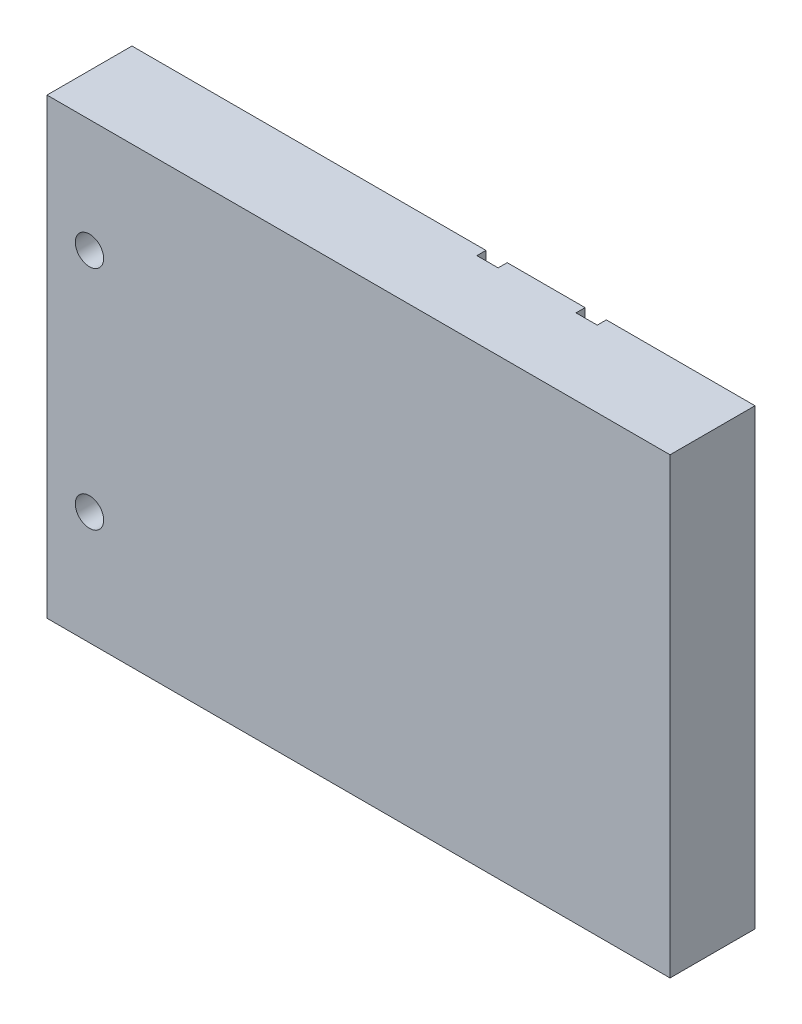
ISO-10303-21;
HEADER;
FILE_DESCRIPTION(('STEP AP214'),'2;1');
FILE_NAME('part.step','',(''),(''),'','','');
FILE_SCHEMA(('AUTOMOTIVE_DESIGN { 1 0 10303 214 1 1 1 1 }'));
ENDSEC;
DATA;
#1=APPLICATION_CONTEXT('core data for automotive mechanical design processes');
#2=APPLICATION_PROTOCOL_DEFINITION('international standard','automotive_design',2000,#1);
#3=PRODUCT_CONTEXT('',#1,'mechanical');
#4=PRODUCT('Part','Part','',(#3));
#5=PRODUCT_RELATED_PRODUCT_CATEGORY('part','',(#4));
#6=PRODUCT_DEFINITION_FORMATION('','',#4);
#7=PRODUCT_DEFINITION_CONTEXT('part definition',#1,'design');
#8=PRODUCT_DEFINITION('design','',#6,#7);
#9=PRODUCT_DEFINITION_SHAPE('','',#8);
#10=(LENGTH_UNIT() NAMED_UNIT(*) SI_UNIT(.MILLI.,.METRE.));
#11=(NAMED_UNIT(*) PLANE_ANGLE_UNIT() SI_UNIT($,.RADIAN.));
#12=(NAMED_UNIT(*) SI_UNIT($,.STERADIAN.) SOLID_ANGLE_UNIT());
#13=UNCERTAINTY_MEASURE_WITH_UNIT(LENGTH_MEASURE(1.E-05),#10,'distance_accuracy_value','');
#14=(GEOMETRIC_REPRESENTATION_CONTEXT(3) GLOBAL_UNCERTAINTY_ASSIGNED_CONTEXT((#13)) GLOBAL_UNIT_ASSIGNED_CONTEXT((#10,
#11,#12)) REPRESENTATION_CONTEXT('',''));
#15=CARTESIAN_POINT('',(0.,0.,0.));
#16=DIRECTION('',(0.,0.,1.));
#17=DIRECTION('',(1.,0.,0.));
#18=AXIS2_PLACEMENT_3D('',#15,#16,#17);
#19=CARTESIAN_POINT('',(-113.980579252451,50.8000000000002,0.));
#20=DIRECTION('',(0.,1.,0.));
#21=DIRECTION('',(0.,0.,1.));
#22=AXIS2_PLACEMENT_3D('',#19,#20,#21);
#23=PLANE('',#22);
#24=DIRECTION('',(0.,0.,1.));
#25=VECTOR('',#24,1.);
#26=CARTESIAN_POINT('',(-69.85,50.8,-9.525));
#27=LINE('',#26,#25);
#28=CARTESIAN_POINT('',(-69.85,50.8,-9.525));
#29=VERTEX_POINT('',#28);
#30=CARTESIAN_POINT('',(-69.85,50.8,9.525));
#31=VERTEX_POINT('',#30);
#32=EDGE_CURVE('E63',#29,#31,#27,.T.);
#33=ORIENTED_EDGE('',*,*,#32,.T.);
#34=DIRECTION('',(1.,0.,0.));
#35=VECTOR('',#34,1.);
#36=CARTESIAN_POINT('',(-69.85,50.8,9.52500000000001));
#37=LINE('',#36,#35);
#38=CARTESIAN_POINT('',(69.85,50.8,9.525));
#39=VERTEX_POINT('',#38);
#40=EDGE_CURVE('E42',#31,#39,#37,.T.);
#41=ORIENTED_EDGE('',*,*,#40,.T.);
#42=DIRECTION('',(0.,0.,-1.));
#43=VECTOR('',#42,1.);
#44=CARTESIAN_POINT('',(69.85,50.8,-9.525));
#45=LINE('',#44,#43);
#46=CARTESIAN_POINT('',(69.85,50.8,-9.525));
#47=VERTEX_POINT('',#46);
#48=EDGE_CURVE('E150',#39,#47,#45,.T.);
#49=ORIENTED_EDGE('',*,*,#48,.T.);
#50=DIRECTION('',(-1.,0.,0.));
#51=VECTOR('',#50,1.);
#52=CARTESIAN_POINT('',(69.85,50.8,-9.525));
#53=LINE('',#52,#51);
#54=CARTESIAN_POINT('',(36.5125,50.8,-9.525));
#55=VERTEX_POINT('',#54);
#56=EDGE_CURVE('E187',#47,#55,#53,.T.);
#57=ORIENTED_EDGE('',*,*,#56,.T.);
#58=DIRECTION('',(0.,0.,1.));
#59=VECTOR('',#58,1.);
#60=CARTESIAN_POINT('',(36.5125,50.8,-9.525));
#61=LINE('',#60,#59);
#62=CARTESIAN_POINT('',(36.5125,50.8,-7.49299999999999));
#63=VERTEX_POINT('',#62);
#64=EDGE_CURVE('E200',#55,#63,#61,.T.);
#65=ORIENTED_EDGE('',*,*,#64,.T.);
#66=DIRECTION('',(-1.,0.,0.));
#67=VECTOR('',#66,1.);
#68=CARTESIAN_POINT('',(36.5125,50.8,-7.49299999999999));
#69=LINE('',#68,#67);
#70=CARTESIAN_POINT('',(31.75,50.8,-7.49299999999999));
#71=VERTEX_POINT('',#70);
#72=EDGE_CURVE('E214',#63,#71,#69,.T.);
#73=ORIENTED_EDGE('',*,*,#72,.T.);
#74=DIRECTION('',(0.,0.,-1.));
#75=VECTOR('',#74,1.);
#76=CARTESIAN_POINT('',(31.75,50.8,-9.525));
#77=LINE('',#76,#75);
#78=CARTESIAN_POINT('',(31.75,50.8,-9.525));
#79=VERTEX_POINT('',#78);
#80=EDGE_CURVE('E228',#71,#79,#77,.T.);
#81=ORIENTED_EDGE('',*,*,#80,.T.);
#82=DIRECTION('',(-1.,0.,0.));
#83=VECTOR('',#82,1.);
#84=CARTESIAN_POINT('',(31.75,50.8,-9.525));
#85=LINE('',#84,#83);
#86=CARTESIAN_POINT('',(14.2875,50.8,-9.525));
#87=VERTEX_POINT('',#86);
#88=EDGE_CURVE('E242',#79,#87,#85,.T.);
#89=ORIENTED_EDGE('',*,*,#88,.T.);
#90=DIRECTION('',(0.,0.,1.));
#91=VECTOR('',#90,1.);
#92=CARTESIAN_POINT('',(14.2875,50.8,-9.525));
#93=LINE('',#92,#91);
#94=CARTESIAN_POINT('',(14.2875,50.8,-7.49299999999999));
#95=VERTEX_POINT('',#94);
#96=EDGE_CURVE('E256',#87,#95,#93,.T.);
#97=ORIENTED_EDGE('',*,*,#96,.T.);
#98=DIRECTION('',(-1.,0.,0.));
#99=VECTOR('',#98,1.);
#100=CARTESIAN_POINT('',(9.525,50.8,-7.49299999999999));
#101=LINE('',#100,#99);
#102=CARTESIAN_POINT('',(9.525,50.8,-7.49299999999999));
#103=VERTEX_POINT('',#102);
#104=EDGE_CURVE('E81',#95,#103,#101,.T.);
#105=ORIENTED_EDGE('',*,*,#104,.T.);
#106=DIRECTION('',(0.,0.,-1.));
#107=VECTOR('',#106,1.);
#108=CARTESIAN_POINT('',(9.525,50.8,-9.525));
#109=LINE('',#108,#107);
#110=CARTESIAN_POINT('',(9.525,50.8,-9.525));
#111=VERTEX_POINT('',#110);
#112=EDGE_CURVE('E75',#103,#111,#109,.T.);
#113=ORIENTED_EDGE('',*,*,#112,.T.);
#114=DIRECTION('',(-1.,0.,0.));
#115=VECTOR('',#114,1.);
#116=CARTESIAN_POINT('',(9.525,50.8,-9.525));
#117=LINE('',#116,#115);
#118=EDGE_CURVE('E70',#111,#29,#117,.T.);
#119=ORIENTED_EDGE('',*,*,#118,.T.);
#120=EDGE_LOOP('',(#33,#41,#49,#57,#65,#73,#81,#89,#97,#105,#113,#119));
#121=FACE_BOUND('',#120,.T.);
#122=ADVANCED_FACE('F33',(#121),#23,.T.);
#123=CARTESIAN_POINT('',(-113.980579252451,-50.7999999999998,0.));
#124=DIRECTION('',(0.,1.,0.));
#125=DIRECTION('',(0.,0.,1.));
#126=AXIS2_PLACEMENT_3D('',#123,#124,#125);
#127=PLANE('',#126);
#128=DIRECTION('',(0.,0.,1.));
#129=VECTOR('',#128,1.);
#130=CARTESIAN_POINT('',(-69.85,-50.8,-9.525));
#131=LINE('',#130,#129);
#132=CARTESIAN_POINT('',(-69.85,-50.8,-9.525));
#133=VERTEX_POINT('',#132);
#134=CARTESIAN_POINT('',(-69.85,-50.8,9.525));
#135=VERTEX_POINT('',#134);
#136=EDGE_CURVE('E158',#133,#135,#131,.T.);
#137=ORIENTED_EDGE('',*,*,#136,.F.);
#138=DIRECTION('',(-1.,0.,0.));
#139=VECTOR('',#138,1.);
#140=CARTESIAN_POINT('',(9.525,-50.8,-9.525));
#141=LINE('',#140,#139);
#142=CARTESIAN_POINT('',(9.525,-50.8,-9.525));
#143=VERTEX_POINT('',#142);
#144=EDGE_CURVE('E90',#143,#133,#141,.T.);
#145=ORIENTED_EDGE('',*,*,#144,.F.);
#146=DIRECTION('',(0.,0.,-1.));
#147=VECTOR('',#146,1.);
#148=CARTESIAN_POINT('',(9.525,-50.8,-9.525));
#149=LINE('',#148,#147);
#150=CARTESIAN_POINT('',(9.525,-50.8,-7.49299999999999));
#151=VERTEX_POINT('',#150);
#152=EDGE_CURVE('E95',#151,#143,#149,.T.);
#153=ORIENTED_EDGE('',*,*,#152,.F.);
#154=DIRECTION('',(-1.,0.,0.));
#155=VECTOR('',#154,1.);
#156=CARTESIAN_POINT('',(9.525,-50.8,-7.49299999999999));
#157=LINE('',#156,#155);
#158=CARTESIAN_POINT('',(14.2875,-50.8,-7.49299999999999));
#159=VERTEX_POINT('',#158);
#160=EDGE_CURVE('E101',#159,#151,#157,.T.);
#161=ORIENTED_EDGE('',*,*,#160,.F.);
#162=DIRECTION('',(0.,0.,1.));
#163=VECTOR('',#162,1.);
#164=CARTESIAN_POINT('',(14.2875,-50.8,-9.525));
#165=LINE('',#164,#163);
#166=CARTESIAN_POINT('',(14.2875,-50.8,-9.525));
#167=VERTEX_POINT('',#166);
#168=EDGE_CURVE('E250',#167,#159,#165,.T.);
#169=ORIENTED_EDGE('',*,*,#168,.F.);
#170=DIRECTION('',(-1.,0.,0.));
#171=VECTOR('',#170,1.);
#172=CARTESIAN_POINT('',(31.75,-50.8,-9.525));
#173=LINE('',#172,#171);
#174=CARTESIAN_POINT('',(31.75,-50.8,-9.525));
#175=VERTEX_POINT('',#174);
#176=EDGE_CURVE('E236',#175,#167,#173,.T.);
#177=ORIENTED_EDGE('',*,*,#176,.F.);
#178=DIRECTION('',(0.,0.,-1.));
#179=VECTOR('',#178,1.);
#180=CARTESIAN_POINT('',(31.75,-50.8,-9.525));
#181=LINE('',#180,#179);
#182=CARTESIAN_POINT('',(31.75,-50.8,-7.49299999999999));
#183=VERTEX_POINT('',#182);
#184=EDGE_CURVE('E222',#183,#175,#181,.T.);
#185=ORIENTED_EDGE('',*,*,#184,.F.);
#186=DIRECTION('',(-1.,0.,0.));
#187=VECTOR('',#186,1.);
#188=CARTESIAN_POINT('',(36.5125,-50.8,-7.49299999999999));
#189=LINE('',#188,#187);
#190=CARTESIAN_POINT('',(36.5125,-50.8,-7.49299999999999));
#191=VERTEX_POINT('',#190);
#192=EDGE_CURVE('E208',#191,#183,#189,.T.);
#193=ORIENTED_EDGE('',*,*,#192,.F.);
#194=DIRECTION('',(0.,0.,1.));
#195=VECTOR('',#194,1.);
#196=CARTESIAN_POINT('',(36.5125,-50.8,-9.525));
#197=LINE('',#196,#195);
#198=CARTESIAN_POINT('',(36.5125,-50.8,-9.525));
#199=VERTEX_POINT('',#198);
#200=EDGE_CURVE('E194',#199,#191,#197,.T.);
#201=ORIENTED_EDGE('',*,*,#200,.F.);
#202=DIRECTION('',(-1.,0.,0.));
#203=VECTOR('',#202,1.);
#204=CARTESIAN_POINT('',(69.85,-50.8,-9.525));
#205=LINE('',#204,#203);
#206=CARTESIAN_POINT('',(69.85,-50.8,-9.525));
#207=VERTEX_POINT('',#206);
#208=EDGE_CURVE('E141',#207,#199,#205,.T.);
#209=ORIENTED_EDGE('',*,*,#208,.F.);
#210=DIRECTION('',(0.,0.,-1.));
#211=VECTOR('',#210,1.);
#212=CARTESIAN_POINT('',(69.85,-50.8,-9.525));
#213=LINE('',#212,#211);
#214=CARTESIAN_POINT('',(69.85,-50.8,9.525));
#215=VERTEX_POINT('',#214);
#216=EDGE_CURVE('E137',#215,#207,#213,.T.);
#217=ORIENTED_EDGE('',*,*,#216,.F.);
#218=DIRECTION('',(1.,0.,0.));
#219=VECTOR('',#218,1.);
#220=CARTESIAN_POINT('',(-69.85,-50.8,9.52500000000001));
#221=LINE('',#220,#219);
#222=EDGE_CURVE('E12',#135,#215,#221,.T.);
#223=ORIENTED_EDGE('',*,*,#222,.F.);
#224=EDGE_LOOP('',(#137,#145,#153,#161,#169,#177,#185,#193,#201,#209,#217,#223));
#225=FACE_BOUND('',#224,.T.);
#226=ADVANCED_FACE('F139',(#225),#127,.F.);
#227=CARTESIAN_POINT('',(-69.85,-50.8,-9.525));
#228=DIRECTION('',(-1.,0.,0.));
#229=DIRECTION('',(0.,0.,1.));
#230=AXIS2_PLACEMENT_3D('',#227,#228,#229);
#231=PLANE('',#230);
#232=ORIENTED_EDGE('',*,*,#32,.F.);
#233=DIRECTION('',(0.,1.,0.));
#234=VECTOR('',#233,1.);
#235=CARTESIAN_POINT('',(-69.85,-50.8,-9.525));
#236=LINE('',#235,#234);
#237=EDGE_CURVE('E162',#133,#29,#236,.T.);
#238=ORIENTED_EDGE('',*,*,#237,.F.);
#239=ORIENTED_EDGE('',*,*,#136,.T.);
#240=DIRECTION('',(0.,1.,0.));
#241=VECTOR('',#240,1.);
#242=CARTESIAN_POINT('',(-69.85,-50.8,9.52500000000001));
#243=LINE('',#242,#241);
#244=EDGE_CURVE('E155',#135,#31,#243,.T.);
#245=ORIENTED_EDGE('',*,*,#244,.T.);
#246=EDGE_LOOP('',(#232,#238,#239,#245));
#247=FACE_BOUND('',#246,.T.);
#248=ADVANCED_FACE('F161',(#247),#231,.T.);
#249=CARTESIAN_POINT('',(9.525,-50.8,-9.525));
#250=DIRECTION('',(0.,0.,-1.));
#251=DIRECTION('',(-1.,0.,0.));
#252=AXIS2_PLACEMENT_3D('',#249,#250,#251);
#253=PLANE('',#252);
#254=CARTESIAN_POINT('',(-60.325,-25.4,-9.525));
#255=DIRECTION('',(0.,0.,-1.));
#256=DIRECTION('',(-1.,0.,0.));
#257=AXIS2_PLACEMENT_3D('',#254,#255,#256);
#258=CIRCLE('',#257,3.17499999999999);
#259=CARTESIAN_POINT('',(-63.5,-25.4,-9.525));
#260=VERTEX_POINT('',#259);
#261=EDGE_CURVE('E372',#260,#260,#258,.T.);
#262=ORIENTED_EDGE('',*,*,#261,.F.);
#263=EDGE_LOOP('',(#262));
#264=FACE_BOUND('',#263,.T.);
#265=CARTESIAN_POINT('',(-60.325,25.4,-9.525));
#266=DIRECTION('',(0.,0.,-1.));
#267=DIRECTION('',(-1.,0.,0.));
#268=AXIS2_PLACEMENT_3D('',#265,#266,#267);
#269=CIRCLE('',#268,3.17499999999999);
#270=CARTESIAN_POINT('',(-63.5,25.4,-9.525));
#271=VERTEX_POINT('',#270);
#272=EDGE_CURVE('E375',#271,#271,#269,.T.);
#273=ORIENTED_EDGE('',*,*,#272,.F.);
#274=EDGE_LOOP('',(#273));
#275=FACE_BOUND('',#274,.T.);
#276=ORIENTED_EDGE('',*,*,#118,.F.);
#277=DIRECTION('',(0.,1.,0.));
#278=VECTOR('',#277,1.);
#279=CARTESIAN_POINT('',(9.525,-50.8,-9.525));
#280=LINE('',#279,#278);
#281=EDGE_CURVE('E287',#143,#111,#280,.T.);
#282=ORIENTED_EDGE('',*,*,#281,.F.);
#283=ORIENTED_EDGE('',*,*,#144,.T.);
#284=ORIENTED_EDGE('',*,*,#237,.T.);
#285=EDGE_LOOP('',(#276,#282,#283,#284));
#286=FACE_BOUND('',#285,.T.);
#287=ADVANCED_FACE('F297',(#264,#275,#286),#253,.T.);
#288=CARTESIAN_POINT('',(9.525,-50.8,-9.525));
#289=DIRECTION('',(1.,0.,0.));
#290=DIRECTION('',(0.,0.,-1.));
#291=AXIS2_PLACEMENT_3D('',#288,#289,#290);
#292=PLANE('',#291);
#293=ORIENTED_EDGE('',*,*,#112,.F.);
#294=DIRECTION('',(0.,1.,0.));
#295=VECTOR('',#294,1.);
#296=CARTESIAN_POINT('',(9.525,-50.8,-7.49299999999999));
#297=LINE('',#296,#295);
#298=EDGE_CURVE('E277',#151,#103,#297,.T.);
#299=ORIENTED_EDGE('',*,*,#298,.F.);
#300=ORIENTED_EDGE('',*,*,#152,.T.);
#301=ORIENTED_EDGE('',*,*,#281,.T.);
#302=EDGE_LOOP('',(#293,#299,#300,#301));
#303=FACE_BOUND('',#302,.T.);
#304=ADVANCED_FACE('F299',(#303),#292,.T.);
#305=CARTESIAN_POINT('',(9.525,-50.8,-7.49299999999999));
#306=DIRECTION('',(0.,0.,-1.));
#307=DIRECTION('',(-1.,0.,0.));
#308=AXIS2_PLACEMENT_3D('',#305,#306,#307);
#309=PLANE('',#308);
#310=ORIENTED_EDGE('',*,*,#104,.F.);
#311=DIRECTION('',(0.,1.,0.));
#312=VECTOR('',#311,1.);
#313=CARTESIAN_POINT('',(14.2875,-50.8,-7.49299999999999));
#314=LINE('',#313,#312);
#315=EDGE_CURVE('E266',#159,#95,#314,.T.);
#316=ORIENTED_EDGE('',*,*,#315,.F.);
#317=ORIENTED_EDGE('',*,*,#160,.T.);
#318=ORIENTED_EDGE('',*,*,#298,.T.);
#319=EDGE_LOOP('',(#310,#316,#317,#318));
#320=FACE_BOUND('',#319,.T.);
#321=ADVANCED_FACE('F301',(#320),#309,.T.);
#322=CARTESIAN_POINT('',(14.2875,-50.8,-9.525));
#323=DIRECTION('',(-1.,0.,0.));
#324=DIRECTION('',(0.,0.,1.));
#325=AXIS2_PLACEMENT_3D('',#322,#323,#324);
#326=PLANE('',#325);
#327=ORIENTED_EDGE('',*,*,#96,.F.);
#328=DIRECTION('',(0.,1.,0.));
#329=VECTOR('',#328,1.);
#330=CARTESIAN_POINT('',(14.2875,-50.8,-9.525));
#331=LINE('',#330,#329);
#332=EDGE_CURVE('E253',#167,#87,#331,.T.);
#333=ORIENTED_EDGE('',*,*,#332,.F.);
#334=ORIENTED_EDGE('',*,*,#168,.T.);
#335=ORIENTED_EDGE('',*,*,#315,.T.);
#336=EDGE_LOOP('',(#327,#333,#334,#335));
#337=FACE_BOUND('',#336,.T.);
#338=ADVANCED_FACE('F305',(#337),#326,.T.);
#339=CARTESIAN_POINT('',(31.75,-50.8,-9.525));
#340=DIRECTION('',(0.,0.,-1.));
#341=DIRECTION('',(-1.,0.,0.));
#342=AXIS2_PLACEMENT_3D('',#339,#340,#341);
#343=PLANE('',#342);
#344=ORIENTED_EDGE('',*,*,#88,.F.);
#345=DIRECTION('',(0.,1.,0.));
#346=VECTOR('',#345,1.);
#347=CARTESIAN_POINT('',(31.75,-50.8,-9.525));
#348=LINE('',#347,#346);
#349=EDGE_CURVE('E239',#175,#79,#348,.T.);
#350=ORIENTED_EDGE('',*,*,#349,.F.);
#351=ORIENTED_EDGE('',*,*,#176,.T.);
#352=ORIENTED_EDGE('',*,*,#332,.T.);
#353=EDGE_LOOP('',(#344,#350,#351,#352));
#354=FACE_BOUND('',#353,.T.);
#355=ADVANCED_FACE('F310',(#354),#343,.T.);
#356=CARTESIAN_POINT('',(31.75,-50.8,-9.525));
#357=DIRECTION('',(1.,0.,0.));
#358=DIRECTION('',(0.,0.,-1.));
#359=AXIS2_PLACEMENT_3D('',#356,#357,#358);
#360=PLANE('',#359);
#361=ORIENTED_EDGE('',*,*,#80,.F.);
#362=DIRECTION('',(0.,1.,0.));
#363=VECTOR('',#362,1.);
#364=CARTESIAN_POINT('',(31.75,-50.8,-7.49299999999999));
#365=LINE('',#364,#363);
#366=EDGE_CURVE('E225',#183,#71,#365,.T.);
#367=ORIENTED_EDGE('',*,*,#366,.F.);
#368=ORIENTED_EDGE('',*,*,#184,.T.);
#369=ORIENTED_EDGE('',*,*,#349,.T.);
#370=EDGE_LOOP('',(#361,#367,#368,#369));
#371=FACE_BOUND('',#370,.T.);
#372=ADVANCED_FACE('F313',(#371),#360,.T.);
#373=CARTESIAN_POINT('',(36.5125,-50.8,-7.49299999999999));
#374=DIRECTION('',(0.,0.,-1.));
#375=DIRECTION('',(-1.,0.,0.));
#376=AXIS2_PLACEMENT_3D('',#373,#374,#375);
#377=PLANE('',#376);
#378=ORIENTED_EDGE('',*,*,#72,.F.);
#379=DIRECTION('',(0.,1.,0.));
#380=VECTOR('',#379,1.);
#381=CARTESIAN_POINT('',(36.5125,-50.8,-7.49299999999999));
#382=LINE('',#381,#380);
#383=EDGE_CURVE('E211',#191,#63,#382,.T.);
#384=ORIENTED_EDGE('',*,*,#383,.F.);
#385=ORIENTED_EDGE('',*,*,#192,.T.);
#386=ORIENTED_EDGE('',*,*,#366,.T.);
#387=EDGE_LOOP('',(#378,#384,#385,#386));
#388=FACE_BOUND('',#387,.T.);
#389=ADVANCED_FACE('F317',(#388),#377,.T.);
#390=CARTESIAN_POINT('',(36.5125,-50.8,-9.525));
#391=DIRECTION('',(-1.,0.,0.));
#392=DIRECTION('',(0.,0.,1.));
#393=AXIS2_PLACEMENT_3D('',#390,#391,#392);
#394=PLANE('',#393);
#395=ORIENTED_EDGE('',*,*,#64,.F.);
#396=DIRECTION('',(0.,1.,0.));
#397=VECTOR('',#396,1.);
#398=CARTESIAN_POINT('',(36.5125,-50.8,-9.525));
#399=LINE('',#398,#397);
#400=EDGE_CURVE('E197',#199,#55,#399,.T.);
#401=ORIENTED_EDGE('',*,*,#400,.F.);
#402=ORIENTED_EDGE('',*,*,#200,.T.);
#403=ORIENTED_EDGE('',*,*,#383,.T.);
#404=EDGE_LOOP('',(#395,#401,#402,#403));
#405=FACE_BOUND('',#404,.T.);
#406=ADVANCED_FACE('F321',(#405),#394,.T.);
#407=CARTESIAN_POINT('',(69.85,-50.8,-9.525));
#408=DIRECTION('',(0.,0.,-1.));
#409=DIRECTION('',(-1.,0.,0.));
#410=AXIS2_PLACEMENT_3D('',#407,#408,#409);
#411=PLANE('',#410);
#412=ORIENTED_EDGE('',*,*,#56,.F.);
#413=DIRECTION('',(0.,1.,0.));
#414=VECTOR('',#413,1.);
#415=CARTESIAN_POINT('',(69.85,-50.8,-9.525));
#416=LINE('',#415,#414);
#417=EDGE_CURVE('E185',#207,#47,#416,.T.);
#418=ORIENTED_EDGE('',*,*,#417,.F.);
#419=ORIENTED_EDGE('',*,*,#208,.T.);
#420=ORIENTED_EDGE('',*,*,#400,.T.);
#421=EDGE_LOOP('',(#412,#418,#419,#420));
#422=FACE_BOUND('',#421,.T.);
#423=ADVANCED_FACE('F324',(#422),#411,.T.);
#424=CARTESIAN_POINT('',(69.85,-50.8,-9.525));
#425=DIRECTION('',(1.,0.,0.));
#426=DIRECTION('',(0.,0.,-1.));
#427=AXIS2_PLACEMENT_3D('',#424,#425,#426);
#428=PLANE('',#427);
#429=ORIENTED_EDGE('',*,*,#48,.F.);
#430=DIRECTION('',(0.,1.,0.));
#431=VECTOR('',#430,1.);
#432=CARTESIAN_POINT('',(69.85,-50.8,9.52500000000001));
#433=LINE('',#432,#431);
#434=EDGE_CURVE('E145',#215,#39,#433,.T.);
#435=ORIENTED_EDGE('',*,*,#434,.F.);
#436=ORIENTED_EDGE('',*,*,#216,.T.);
#437=ORIENTED_EDGE('',*,*,#417,.T.);
#438=EDGE_LOOP('',(#429,#435,#436,#437));
#439=FACE_BOUND('',#438,.T.);
#440=ADVANCED_FACE('F149',(#439),#428,.T.);
#441=CARTESIAN_POINT('',(-69.85,-50.8,9.52500000000001));
#442=DIRECTION('',(0.,0.,1.));
#443=DIRECTION('',(1.,0.,0.));
#444=AXIS2_PLACEMENT_3D('',#441,#442,#443);
#445=PLANE('',#444);
#446=CARTESIAN_POINT('',(-60.325,-25.4,9.52500000000001));
#447=DIRECTION('',(0.,0.,1.));
#448=DIRECTION('',(1.,0.,0.));
#449=AXIS2_PLACEMENT_3D('',#446,#447,#448);
#450=CIRCLE('',#449,3.17499999999999);
#451=CARTESIAN_POINT('',(-57.15,-25.4,9.52500000000001));
#452=VERTEX_POINT('',#451);
#453=EDGE_CURVE('E374',#452,#452,#450,.T.);
#454=ORIENTED_EDGE('',*,*,#453,.F.);
#455=EDGE_LOOP('',(#454));
#456=FACE_BOUND('',#455,.T.);
#457=CARTESIAN_POINT('',(-60.325,25.4,9.52500000000001));
#458=DIRECTION('',(0.,0.,1.));
#459=DIRECTION('',(1.,0.,0.));
#460=AXIS2_PLACEMENT_3D('',#457,#458,#459);
#461=CIRCLE('',#460,3.17499999999999);
#462=CARTESIAN_POINT('',(-57.15,25.4,9.52500000000001));
#463=VERTEX_POINT('',#462);
#464=EDGE_CURVE('E176',#463,#463,#461,.T.);
#465=ORIENTED_EDGE('',*,*,#464,.F.);
#466=EDGE_LOOP('',(#465));
#467=FACE_BOUND('',#466,.T.);
#468=ORIENTED_EDGE('',*,*,#40,.F.);
#469=ORIENTED_EDGE('',*,*,#244,.F.);
#470=ORIENTED_EDGE('',*,*,#222,.T.);
#471=ORIENTED_EDGE('',*,*,#434,.T.);
#472=EDGE_LOOP('',(#468,#469,#470,#471));
#473=FACE_BOUND('',#472,.T.);
#474=ADVANCED_FACE('F154',(#456,#467,#473),#445,.T.);
#475=CARTESIAN_POINT('',(-60.325,25.4,-9.525));
#476=DIRECTION('',(0.,0.,-1.));
#477=DIRECTION('',(-1.,0.,0.));
#478=AXIS2_PLACEMENT_3D('',#475,#476,#477);
#479=CYLINDRICAL_SURFACE('',#478,3.17499999999999);
#480=ORIENTED_EDGE('',*,*,#272,.T.);
#481=EDGE_LOOP('',(#480));
#482=FACE_BOUND('',#481,.T.);
#483=ORIENTED_EDGE('',*,*,#464,.T.);
#484=EDGE_LOOP('',(#483));
#485=FACE_BOUND('',#484,.T.);
#486=ADVANCED_FACE('F326',(#482,#485),#479,.F.);
#487=CARTESIAN_POINT('',(-60.325,-25.4,-9.525));
#488=DIRECTION('',(0.,0.,-1.));
#489=DIRECTION('',(-1.,0.,0.));
#490=AXIS2_PLACEMENT_3D('',#487,#488,#489);
#491=CYLINDRICAL_SURFACE('',#490,3.17499999999999);
#492=ORIENTED_EDGE('',*,*,#261,.T.);
#493=EDGE_LOOP('',(#492));
#494=FACE_BOUND('',#493,.T.);
#495=ORIENTED_EDGE('',*,*,#453,.T.);
#496=EDGE_LOOP('',(#495));
#497=FACE_BOUND('',#496,.T.);
#498=ADVANCED_FACE('F331',(#494,#497),#491,.F.);
#499=CLOSED_SHELL('',(#122,#226,#248,#287,#304,#321,#338,#355,#372,#389,#406,#423,#440,#474,
#486,#498));
#500=MANIFOLD_SOLID_BREP('B2',#499);
#501=ADVANCED_BREP_SHAPE_REPRESENTATION('',(#18,#500),#14);
#502=SHAPE_DEFINITION_REPRESENTATION(#9,#501);
ENDSEC;
END-ISO-10303-21;
